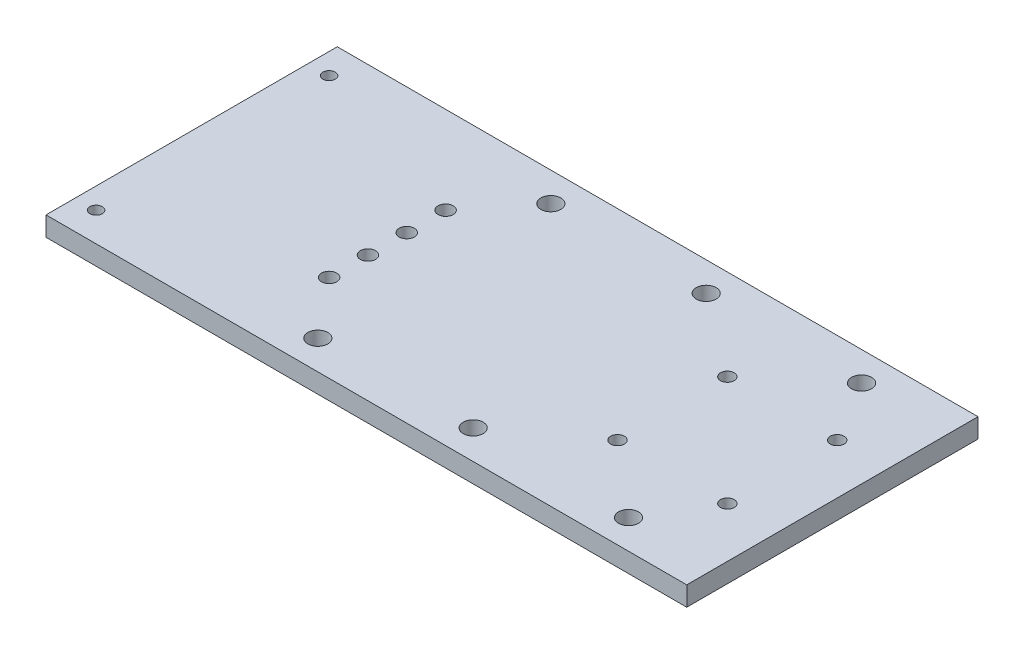
ISO-10303-21;
HEADER;
FILE_DESCRIPTION(('STEP AP214'),'2;1');
FILE_NAME('part.step','',(''),(''),'','','');
FILE_SCHEMA(('AUTOMOTIVE_DESIGN { 1 0 10303 214 1 1 1 1 }'));
ENDSEC;
DATA;
#1=APPLICATION_CONTEXT('core data for automotive mechanical design processes');
#2=APPLICATION_PROTOCOL_DEFINITION('international standard','automotive_design',2000,#1);
#3=PRODUCT_CONTEXT('',#1,'mechanical');
#4=PRODUCT('Part','Part','',(#3));
#5=PRODUCT_RELATED_PRODUCT_CATEGORY('part','',(#4));
#6=PRODUCT_DEFINITION_FORMATION('','',#4);
#7=PRODUCT_DEFINITION_CONTEXT('part definition',#1,'design');
#8=PRODUCT_DEFINITION('design','',#6,#7);
#9=PRODUCT_DEFINITION_SHAPE('','',#8);
#10=(LENGTH_UNIT() NAMED_UNIT(*) SI_UNIT(.MILLI.,.METRE.));
#11=(NAMED_UNIT(*) PLANE_ANGLE_UNIT() SI_UNIT($,.RADIAN.));
#12=(NAMED_UNIT(*) SI_UNIT($,.STERADIAN.) SOLID_ANGLE_UNIT());
#13=UNCERTAINTY_MEASURE_WITH_UNIT(LENGTH_MEASURE(1.E-05),#10,'distance_accuracy_value','');
#14=(GEOMETRIC_REPRESENTATION_CONTEXT(3) GLOBAL_UNCERTAINTY_ASSIGNED_CONTEXT((#13)) GLOBAL_UNIT_ASSIGNED_CONTEXT((#10,
#11,#12)) REPRESENTATION_CONTEXT('',''));
#15=CARTESIAN_POINT('',(0.,0.,0.));
#16=DIRECTION('',(0.,0.,1.));
#17=DIRECTION('',(1.,0.,0.));
#18=AXIS2_PLACEMENT_3D('',#15,#16,#17);
#19=CARTESIAN_POINT('',(104.775,6.35,47.625));
#20=DIRECTION('',(-1.,0.,0.));
#21=DIRECTION('',(0.,0.,1.));
#22=AXIS2_PLACEMENT_3D('',#19,#20,#21);
#23=PLANE('',#22);
#24=DIRECTION('',(0.,0.,-1.));
#25=VECTOR('',#24,1.);
#26=CARTESIAN_POINT('',(104.775,0.,47.625));
#27=LINE('',#26,#25);
#28=CARTESIAN_POINT('',(104.775,0.,47.625));
#29=VERTEX_POINT('',#28);
#30=CARTESIAN_POINT('',(104.775,0.,-47.625));
#31=VERTEX_POINT('',#30);
#32=EDGE_CURVE('E99',#29,#31,#27,.T.);
#33=ORIENTED_EDGE('',*,*,#32,.T.);
#34=DIRECTION('',(0.,-1.,0.));
#35=VECTOR('',#34,1.);
#36=CARTESIAN_POINT('',(104.775,6.35,-47.625));
#37=LINE('',#36,#35);
#38=CARTESIAN_POINT('',(104.775,6.35,-47.625));
#39=VERTEX_POINT('',#38);
#40=EDGE_CURVE('E11',#39,#31,#37,.T.);
#41=ORIENTED_EDGE('',*,*,#40,.F.);
#42=DIRECTION('',(0.,0.,-1.));
#43=VECTOR('',#42,1.);
#44=CARTESIAN_POINT('',(104.775,6.35,47.625));
#45=LINE('',#44,#43);
#46=CARTESIAN_POINT('',(104.775,6.35,47.625));
#47=VERTEX_POINT('',#46);
#48=EDGE_CURVE('E87',#47,#39,#45,.T.);
#49=ORIENTED_EDGE('',*,*,#48,.F.);
#50=DIRECTION('',(0.,-1.,0.));
#51=VECTOR('',#50,1.);
#52=CARTESIAN_POINT('',(104.775,6.35,47.625));
#53=LINE('',#52,#51);
#54=EDGE_CURVE('E95',#47,#29,#53,.T.);
#55=ORIENTED_EDGE('',*,*,#54,.T.);
#56=EDGE_LOOP('',(#33,#41,#49,#55));
#57=FACE_BOUND('',#56,.T.);
#58=ADVANCED_FACE('F36',(#57),#23,.F.);
#59=CARTESIAN_POINT('',(-104.775,6.35,-47.625));
#60=DIRECTION('',(0.,0.,1.));
#61=DIRECTION('',(1.,0.,0.));
#62=AXIS2_PLACEMENT_3D('',#59,#60,#61);
#63=PLANE('',#62);
#64=DIRECTION('',(-1.,0.,0.));
#65=VECTOR('',#64,1.);
#66=CARTESIAN_POINT('',(-104.775,0.,-47.625));
#67=LINE('',#66,#65);
#68=CARTESIAN_POINT('',(-104.775,0.,-47.625));
#69=VERTEX_POINT('',#68);
#70=EDGE_CURVE('E91',#31,#69,#67,.T.);
#71=ORIENTED_EDGE('',*,*,#70,.T.);
#72=DIRECTION('',(0.,-1.,0.));
#73=VECTOR('',#72,1.);
#74=CARTESIAN_POINT('',(-104.775,6.35,-47.625));
#75=LINE('',#74,#73);
#76=CARTESIAN_POINT('',(-104.775,6.35,-47.625));
#77=VERTEX_POINT('',#76);
#78=EDGE_CURVE('E44',#77,#69,#75,.T.);
#79=ORIENTED_EDGE('',*,*,#78,.F.);
#80=DIRECTION('',(-1.,0.,0.));
#81=VECTOR('',#80,1.);
#82=CARTESIAN_POINT('',(-104.775,6.35,-47.625));
#83=LINE('',#82,#81);
#84=EDGE_CURVE('E82',#39,#77,#83,.T.);
#85=ORIENTED_EDGE('',*,*,#84,.F.);
#86=ORIENTED_EDGE('',*,*,#40,.T.);
#87=EDGE_LOOP('',(#71,#79,#85,#86));
#88=FACE_BOUND('',#87,.T.);
#89=ADVANCED_FACE('F90',(#88),#63,.F.);
#90=CARTESIAN_POINT('',(-104.775,6.35,47.625));
#91=DIRECTION('',(1.,0.,0.));
#92=DIRECTION('',(0.,0.,-1.));
#93=AXIS2_PLACEMENT_3D('',#90,#91,#92);
#94=PLANE('',#93);
#95=DIRECTION('',(0.,0.,1.));
#96=VECTOR('',#95,1.);
#97=CARTESIAN_POINT('',(-104.775,0.,47.625));
#98=LINE('',#97,#96);
#99=CARTESIAN_POINT('',(-104.775,0.,47.625));
#100=VERTEX_POINT('',#99);
#101=EDGE_CURVE('E69',#69,#100,#98,.T.);
#102=ORIENTED_EDGE('',*,*,#101,.T.);
#103=DIRECTION('',(0.,-1.,0.));
#104=VECTOR('',#103,1.);
#105=CARTESIAN_POINT('',(-104.775,6.35,47.625));
#106=LINE('',#105,#104);
#107=CARTESIAN_POINT('',(-104.775,6.35,47.625));
#108=VERTEX_POINT('',#107);
#109=EDGE_CURVE('E92',#108,#100,#106,.T.);
#110=ORIENTED_EDGE('',*,*,#109,.F.);
#111=DIRECTION('',(0.,0.,1.));
#112=VECTOR('',#111,1.);
#113=CARTESIAN_POINT('',(-104.775,6.35,47.625));
#114=LINE('',#113,#112);
#115=EDGE_CURVE('E85',#77,#108,#114,.T.);
#116=ORIENTED_EDGE('',*,*,#115,.F.);
#117=ORIENTED_EDGE('',*,*,#78,.T.);
#118=EDGE_LOOP('',(#102,#110,#116,#117));
#119=FACE_BOUND('',#118,.T.);
#120=ADVANCED_FACE('F93',(#119),#94,.F.);
#121=CARTESIAN_POINT('',(-104.775,6.35,47.625));
#122=DIRECTION('',(0.,0.,-1.));
#123=DIRECTION('',(-1.,0.,0.));
#124=AXIS2_PLACEMENT_3D('',#121,#122,#123);
#125=PLANE('',#124);
#126=DIRECTION('',(1.,0.,0.));
#127=VECTOR('',#126,1.);
#128=CARTESIAN_POINT('',(-104.775,0.,47.625));
#129=LINE('',#128,#127);
#130=EDGE_CURVE('E75',#100,#29,#129,.T.);
#131=ORIENTED_EDGE('',*,*,#130,.T.);
#132=ORIENTED_EDGE('',*,*,#54,.F.);
#133=DIRECTION('',(1.,0.,0.));
#134=VECTOR('',#133,1.);
#135=CARTESIAN_POINT('',(-104.775,6.35,47.625));
#136=LINE('',#135,#134);
#137=EDGE_CURVE('E52',#108,#47,#136,.T.);
#138=ORIENTED_EDGE('',*,*,#137,.F.);
#139=ORIENTED_EDGE('',*,*,#109,.T.);
#140=EDGE_LOOP('',(#131,#132,#138,#139));
#141=FACE_BOUND('',#140,.T.);
#142=ADVANCED_FACE('F107',(#141),#125,.F.);
#143=CARTESIAN_POINT('',(0.,6.35,0.));
#144=DIRECTION('',(0.,-1.,0.));
#145=DIRECTION('',(0.,0.,-1.));
#146=AXIS2_PLACEMENT_3D('',#143,#144,#145);
#147=PLANE('',#146);
#148=CARTESIAN_POINT('',(-25.4,6.35,38.1));
#149=DIRECTION('',(0.,-1.,0.));
#150=DIRECTION('',(0.,0.,-1.));
#151=AXIS2_PLACEMENT_3D('',#148,#149,#150);
#152=CIRCLE('',#151,3.2639);
#153=CARTESIAN_POINT('',(-25.4,6.35,34.8361));
#154=VERTEX_POINT('',#153);
#155=EDGE_CURVE('E203',#154,#154,#152,.T.);
#156=ORIENTED_EDGE('',*,*,#155,.T.);
#157=EDGE_LOOP('',(#156));
#158=FACE_BOUND('',#157,.T.);
#159=CARTESIAN_POINT('',(25.4,6.35,38.1));
#160=DIRECTION('',(0.,-1.,0.));
#161=DIRECTION('',(0.,0.,-1.));
#162=AXIS2_PLACEMENT_3D('',#159,#160,#161);
#163=CIRCLE('',#162,3.2639);
#164=CARTESIAN_POINT('',(25.4,6.35,34.8361));
#165=VERTEX_POINT('',#164);
#166=EDGE_CURVE('E197',#165,#165,#163,.T.);
#167=ORIENTED_EDGE('',*,*,#166,.T.);
#168=EDGE_LOOP('',(#167));
#169=FACE_BOUND('',#168,.T.);
#170=CARTESIAN_POINT('',(76.2,6.35,38.1));
#171=DIRECTION('',(0.,-1.,0.));
#172=DIRECTION('',(0.,0.,-1.));
#173=AXIS2_PLACEMENT_3D('',#170,#171,#172);
#174=CIRCLE('',#173,3.2639);
#175=CARTESIAN_POINT('',(76.2,6.35,34.8361));
#176=VERTEX_POINT('',#175);
#177=EDGE_CURVE('E191',#176,#176,#174,.T.);
#178=ORIENTED_EDGE('',*,*,#177,.T.);
#179=EDGE_LOOP('',(#178));
#180=FACE_BOUND('',#179,.T.);
#181=CARTESIAN_POINT('',(-25.4,6.35,-38.1));
#182=DIRECTION('',(0.,1.,0.));
#183=DIRECTION('',(0.,0.,1.));
#184=AXIS2_PLACEMENT_3D('',#181,#182,#183);
#185=CIRCLE('',#184,3.2639);
#186=CARTESIAN_POINT('',(-25.4,6.35,-34.8361));
#187=VERTEX_POINT('',#186);
#188=EDGE_CURVE('E186',#187,#187,#185,.T.);
#189=ORIENTED_EDGE('',*,*,#188,.F.);
#190=EDGE_LOOP('',(#189));
#191=FACE_BOUND('',#190,.T.);
#192=CARTESIAN_POINT('',(25.4,6.35,-38.1));
#193=DIRECTION('',(0.,1.,0.));
#194=DIRECTION('',(0.,0.,1.));
#195=AXIS2_PLACEMENT_3D('',#192,#193,#194);
#196=CIRCLE('',#195,3.2639);
#197=CARTESIAN_POINT('',(25.4,6.35,-34.8361));
#198=VERTEX_POINT('',#197);
#199=EDGE_CURVE('E180',#198,#198,#196,.T.);
#200=ORIENTED_EDGE('',*,*,#199,.F.);
#201=EDGE_LOOP('',(#200));
#202=FACE_BOUND('',#201,.T.);
#203=CARTESIAN_POINT('',(76.2,6.35,-38.1));
#204=DIRECTION('',(0.,1.,0.));
#205=DIRECTION('',(0.,0.,1.));
#206=AXIS2_PLACEMENT_3D('',#203,#204,#205);
#207=CIRCLE('',#206,3.2639);
#208=CARTESIAN_POINT('',(76.2,6.35,-34.8361));
#209=VERTEX_POINT('',#208);
#210=EDGE_CURVE('E173',#209,#209,#207,.T.);
#211=ORIENTED_EDGE('',*,*,#210,.F.);
#212=EDGE_LOOP('',(#211));
#213=FACE_BOUND('',#212,.T.);
#214=CARTESIAN_POINT('',(52.47132,6.35,17.96034));
#215=DIRECTION('',(0.,1.,0.));
#216=DIRECTION('',(0.,0.,1.));
#217=AXIS2_PLACEMENT_3D('',#214,#215,#216);
#218=CIRCLE('',#217,2.2479);
#219=CARTESIAN_POINT('',(52.47132,6.35,20.20824));
#220=VERTEX_POINT('',#219);
#221=EDGE_CURVE('E155',#220,#220,#218,.T.);
#222=ORIENTED_EDGE('',*,*,#221,.F.);
#223=EDGE_LOOP('',(#222));
#224=FACE_BOUND('',#223,.T.);
#225=CARTESIAN_POINT('',(88.392,6.35,17.96034));
#226=DIRECTION('',(0.,1.,0.));
#227=DIRECTION('',(0.,0.,1.));
#228=AXIS2_PLACEMENT_3D('',#225,#226,#227);
#229=CIRCLE('',#228,2.2479);
#230=CARTESIAN_POINT('',(88.392,6.35,20.20824));
#231=VERTEX_POINT('',#230);
#232=EDGE_CURVE('E162',#231,#231,#229,.T.);
#233=ORIENTED_EDGE('',*,*,#232,.F.);
#234=EDGE_LOOP('',(#233));
#235=FACE_BOUND('',#234,.T.);
#236=CARTESIAN_POINT('',(88.392,6.35,-17.96034));
#237=DIRECTION('',(0.,1.,0.));
#238=DIRECTION('',(0.,0.,1.));
#239=AXIS2_PLACEMENT_3D('',#236,#237,#238);
#240=CIRCLE('',#239,2.2479);
#241=CARTESIAN_POINT('',(88.392,6.35,-15.71244));
#242=VERTEX_POINT('',#241);
#243=EDGE_CURVE('E168',#242,#242,#240,.T.);
#244=ORIENTED_EDGE('',*,*,#243,.F.);
#245=EDGE_LOOP('',(#244));
#246=FACE_BOUND('',#245,.T.);
#247=CARTESIAN_POINT('',(52.47132,6.35,-17.96034));
#248=DIRECTION('',(0.,1.,0.));
#249=DIRECTION('',(0.,0.,1.));
#250=AXIS2_PLACEMENT_3D('',#247,#248,#249);
#251=CIRCLE('',#250,2.2479);
#252=CARTESIAN_POINT('',(52.47132,6.35,-15.71244));
#253=VERTEX_POINT('',#252);
#254=EDGE_CURVE('E149',#253,#253,#251,.T.);
#255=ORIENTED_EDGE('',*,*,#254,.F.);
#256=EDGE_LOOP('',(#255));
#257=FACE_BOUND('',#256,.T.);
#258=CARTESIAN_POINT('',(-40.767,6.35,-6.35));
#259=DIRECTION('',(0.,-1.,0.));
#260=DIRECTION('',(0.,0.,-1.));
#261=AXIS2_PLACEMENT_3D('',#258,#259,#260);
#262=CIRCLE('',#261,2.4892);
#263=CARTESIAN_POINT('',(-40.767,6.35,-8.83920000000001));
#264=VERTEX_POINT('',#263);
#265=EDGE_CURVE('E144',#264,#264,#262,.T.);
#266=ORIENTED_EDGE('',*,*,#265,.T.);
#267=EDGE_LOOP('',(#266));
#268=FACE_BOUND('',#267,.T.);
#269=CARTESIAN_POINT('',(-40.767,6.35,-19.05));
#270=DIRECTION('',(0.,-1.,0.));
#271=DIRECTION('',(0.,0.,-1.));
#272=AXIS2_PLACEMENT_3D('',#269,#270,#271);
#273=CIRCLE('',#272,2.4892);
#274=CARTESIAN_POINT('',(-40.767,6.35,-21.5392));
#275=VERTEX_POINT('',#274);
#276=EDGE_CURVE('E137',#275,#275,#273,.T.);
#277=ORIENTED_EDGE('',*,*,#276,.T.);
#278=EDGE_LOOP('',(#277));
#279=FACE_BOUND('',#278,.T.);
#280=CARTESIAN_POINT('',(-40.767,6.35,6.35));
#281=DIRECTION('',(0.,1.,0.));
#282=DIRECTION('',(0.,0.,1.));
#283=AXIS2_PLACEMENT_3D('',#280,#281,#282);
#284=CIRCLE('',#283,2.4892);
#285=CARTESIAN_POINT('',(-40.767,6.35,8.83920000000001));
#286=VERTEX_POINT('',#285);
#287=EDGE_CURVE('E132',#286,#286,#284,.T.);
#288=ORIENTED_EDGE('',*,*,#287,.F.);
#289=EDGE_LOOP('',(#288));
#290=FACE_BOUND('',#289,.T.);
#291=CARTESIAN_POINT('',(-40.767,6.35,19.05));
#292=DIRECTION('',(0.,1.,0.));
#293=DIRECTION('',(0.,0.,1.));
#294=AXIS2_PLACEMENT_3D('',#291,#292,#293);
#295=CIRCLE('',#294,2.4892);
#296=CARTESIAN_POINT('',(-40.767,6.35,21.5392));
#297=VERTEX_POINT('',#296);
#298=EDGE_CURVE('E125',#297,#297,#295,.T.);
#299=ORIENTED_EDGE('',*,*,#298,.F.);
#300=EDGE_LOOP('',(#299));
#301=FACE_BOUND('',#300,.T.);
#302=CARTESIAN_POINT('',(-97.917,6.35,-38.1));
#303=DIRECTION('',(0.,-1.,0.));
#304=DIRECTION('',(0.,0.,-1.));
#305=AXIS2_PLACEMENT_3D('',#302,#303,#304);
#306=CIRCLE('',#305,2.01930000000001);
#307=CARTESIAN_POINT('',(-97.917,6.35,-40.1193));
#308=VERTEX_POINT('',#307);
#309=EDGE_CURVE('E119',#308,#308,#306,.T.);
#310=ORIENTED_EDGE('',*,*,#309,.T.);
#311=EDGE_LOOP('',(#310));
#312=FACE_BOUND('',#311,.T.);
#313=CARTESIAN_POINT('',(-97.917,6.35,38.1));
#314=DIRECTION('',(0.,1.,0.));
#315=DIRECTION('',(0.,0.,1.));
#316=AXIS2_PLACEMENT_3D('',#313,#314,#315);
#317=CIRCLE('',#316,2.01930000000001);
#318=CARTESIAN_POINT('',(-97.917,6.35,40.1193));
#319=VERTEX_POINT('',#318);
#320=EDGE_CURVE('E113',#319,#319,#317,.T.);
#321=ORIENTED_EDGE('',*,*,#320,.F.);
#322=EDGE_LOOP('',(#321));
#323=FACE_BOUND('',#322,.T.);
#324=ORIENTED_EDGE('',*,*,#48,.T.);
#325=ORIENTED_EDGE('',*,*,#84,.T.);
#326=ORIENTED_EDGE('',*,*,#115,.T.);
#327=ORIENTED_EDGE('',*,*,#137,.T.);
#328=EDGE_LOOP('',(#324,#325,#326,#327));
#329=FACE_BOUND('',#328,.T.);
#330=ADVANCED_FACE('F83',(#158,#169,#180,#191,#202,#213,#224,#235,#246,#257,#268,#279,#290,#301,
#312,#323,#329),#147,.F.);
#331=CARTESIAN_POINT('',(0.,0.,0.));
#332=DIRECTION('',(0.,-1.,0.));
#333=DIRECTION('',(0.,0.,-1.));
#334=AXIS2_PLACEMENT_3D('',#331,#332,#333);
#335=PLANE('',#334);
#336=CARTESIAN_POINT('',(-25.4,0.,38.1));
#337=DIRECTION('',(0.,-1.,0.));
#338=DIRECTION('',(0.,0.,-1.));
#339=AXIS2_PLACEMENT_3D('',#336,#337,#338);
#340=CIRCLE('',#339,3.2639);
#341=CARTESIAN_POINT('',(-25.4,0.,34.8361));
#342=VERTEX_POINT('',#341);
#343=EDGE_CURVE('E177',#342,#342,#340,.T.);
#344=ORIENTED_EDGE('',*,*,#343,.F.);
#345=EDGE_LOOP('',(#344));
#346=FACE_BOUND('',#345,.T.);
#347=CARTESIAN_POINT('',(25.4,0.,38.1));
#348=DIRECTION('',(0.,-1.,0.));
#349=DIRECTION('',(0.,0.,-1.));
#350=AXIS2_PLACEMENT_3D('',#347,#348,#349);
#351=CIRCLE('',#350,3.2639);
#352=CARTESIAN_POINT('',(25.4,0.,34.8361));
#353=VERTEX_POINT('',#352);
#354=EDGE_CURVE('E200',#353,#353,#351,.T.);
#355=ORIENTED_EDGE('',*,*,#354,.F.);
#356=EDGE_LOOP('',(#355));
#357=FACE_BOUND('',#356,.T.);
#358=CARTESIAN_POINT('',(76.2,0.,38.1));
#359=DIRECTION('',(0.,-1.,0.));
#360=DIRECTION('',(0.,0.,-1.));
#361=AXIS2_PLACEMENT_3D('',#358,#359,#360);
#362=CIRCLE('',#361,3.2639);
#363=CARTESIAN_POINT('',(76.2,0.,34.8361));
#364=VERTEX_POINT('',#363);
#365=EDGE_CURVE('E194',#364,#364,#362,.T.);
#366=ORIENTED_EDGE('',*,*,#365,.F.);
#367=EDGE_LOOP('',(#366));
#368=FACE_BOUND('',#367,.T.);
#369=CARTESIAN_POINT('',(-25.4,0.,-38.1));
#370=DIRECTION('',(0.,1.,0.));
#371=DIRECTION('',(0.,0.,1.));
#372=AXIS2_PLACEMENT_3D('',#369,#370,#371);
#373=CIRCLE('',#372,3.2639);
#374=CARTESIAN_POINT('',(-25.4,0.,-34.8361));
#375=VERTEX_POINT('',#374);
#376=EDGE_CURVE('E159',#375,#375,#373,.T.);
#377=ORIENTED_EDGE('',*,*,#376,.T.);
#378=EDGE_LOOP('',(#377));
#379=FACE_BOUND('',#378,.T.);
#380=CARTESIAN_POINT('',(25.4,0.,-38.1));
#381=DIRECTION('',(0.,1.,0.));
#382=DIRECTION('',(0.,0.,1.));
#383=AXIS2_PLACEMENT_3D('',#380,#381,#382);
#384=CIRCLE('',#383,3.2639);
#385=CARTESIAN_POINT('',(25.4,0.,-34.8361));
#386=VERTEX_POINT('',#385);
#387=EDGE_CURVE('E183',#386,#386,#384,.T.);
#388=ORIENTED_EDGE('',*,*,#387,.T.);
#389=EDGE_LOOP('',(#388));
#390=FACE_BOUND('',#389,.T.);
#391=CARTESIAN_POINT('',(76.2,0.,-38.1));
#392=DIRECTION('',(0.,1.,0.));
#393=DIRECTION('',(0.,0.,1.));
#394=AXIS2_PLACEMENT_3D('',#391,#392,#393);
#395=CIRCLE('',#394,3.2639);
#396=CARTESIAN_POINT('',(76.2,0.,-34.8361));
#397=VERTEX_POINT('',#396);
#398=EDGE_CURVE('E176',#397,#397,#395,.T.);
#399=ORIENTED_EDGE('',*,*,#398,.T.);
#400=EDGE_LOOP('',(#399));
#401=FACE_BOUND('',#400,.T.);
#402=CARTESIAN_POINT('',(52.47132,0.,17.96034));
#403=DIRECTION('',(0.,1.,0.));
#404=DIRECTION('',(0.,0.,1.));
#405=AXIS2_PLACEMENT_3D('',#402,#403,#404);
#406=CIRCLE('',#405,2.2479);
#407=CARTESIAN_POINT('',(52.47132,0.,20.20824));
#408=VERTEX_POINT('',#407);
#409=EDGE_CURVE('E158',#408,#408,#406,.T.);
#410=ORIENTED_EDGE('',*,*,#409,.T.);
#411=EDGE_LOOP('',(#410));
#412=FACE_BOUND('',#411,.T.);
#413=CARTESIAN_POINT('',(88.392,0.,17.96034));
#414=DIRECTION('',(0.,1.,0.));
#415=DIRECTION('',(0.,0.,1.));
#416=AXIS2_PLACEMENT_3D('',#413,#414,#415);
#417=CIRCLE('',#416,2.2479);
#418=CARTESIAN_POINT('',(88.392,0.,20.20824));
#419=VERTEX_POINT('',#418);
#420=EDGE_CURVE('E165',#419,#419,#417,.T.);
#421=ORIENTED_EDGE('',*,*,#420,.T.);
#422=EDGE_LOOP('',(#421));
#423=FACE_BOUND('',#422,.T.);
#424=CARTESIAN_POINT('',(88.392,0.,-17.96034));
#425=DIRECTION('',(0.,1.,0.));
#426=DIRECTION('',(0.,0.,1.));
#427=AXIS2_PLACEMENT_3D('',#424,#425,#426);
#428=CIRCLE('',#427,2.2479);
#429=CARTESIAN_POINT('',(88.392,0.,-15.71244));
#430=VERTEX_POINT('',#429);
#431=EDGE_CURVE('E152',#430,#430,#428,.T.);
#432=ORIENTED_EDGE('',*,*,#431,.T.);
#433=EDGE_LOOP('',(#432));
#434=FACE_BOUND('',#433,.T.);
#435=CARTESIAN_POINT('',(52.47132,0.,-17.96034));
#436=DIRECTION('',(0.,1.,0.));
#437=DIRECTION('',(0.,0.,1.));
#438=AXIS2_PLACEMENT_3D('',#435,#436,#437);
#439=CIRCLE('',#438,2.2479);
#440=CARTESIAN_POINT('',(52.47132,0.,-15.71244));
#441=VERTEX_POINT('',#440);
#442=EDGE_CURVE('E141',#441,#441,#439,.T.);
#443=ORIENTED_EDGE('',*,*,#442,.T.);
#444=EDGE_LOOP('',(#443));
#445=FACE_BOUND('',#444,.T.);
#446=CARTESIAN_POINT('',(-40.767,0.,-6.35));
#447=DIRECTION('',(0.,-1.,0.));
#448=DIRECTION('',(0.,0.,-1.));
#449=AXIS2_PLACEMENT_3D('',#446,#447,#448);
#450=CIRCLE('',#449,2.4892);
#451=CARTESIAN_POINT('',(-40.767,0.,-8.83920000000001));
#452=VERTEX_POINT('',#451);
#453=EDGE_CURVE('E129',#452,#452,#450,.T.);
#454=ORIENTED_EDGE('',*,*,#453,.F.);
#455=EDGE_LOOP('',(#454));
#456=FACE_BOUND('',#455,.T.);
#457=CARTESIAN_POINT('',(-40.767,0.,-19.05));
#458=DIRECTION('',(0.,-1.,0.));
#459=DIRECTION('',(0.,0.,-1.));
#460=AXIS2_PLACEMENT_3D('',#457,#458,#459);
#461=CIRCLE('',#460,2.4892);
#462=CARTESIAN_POINT('',(-40.767,0.,-21.5392));
#463=VERTEX_POINT('',#462);
#464=EDGE_CURVE('E140',#463,#463,#461,.T.);
#465=ORIENTED_EDGE('',*,*,#464,.F.);
#466=EDGE_LOOP('',(#465));
#467=FACE_BOUND('',#466,.T.);
#468=CARTESIAN_POINT('',(-40.767,0.,6.35));
#469=DIRECTION('',(0.,1.,0.));
#470=DIRECTION('',(0.,0.,1.));
#471=AXIS2_PLACEMENT_3D('',#468,#469,#470);
#472=CIRCLE('',#471,2.4892);
#473=CARTESIAN_POINT('',(-40.767,0.,8.83920000000001));
#474=VERTEX_POINT('',#473);
#475=EDGE_CURVE('E122',#474,#474,#472,.T.);
#476=ORIENTED_EDGE('',*,*,#475,.T.);
#477=EDGE_LOOP('',(#476));
#478=FACE_BOUND('',#477,.T.);
#479=CARTESIAN_POINT('',(-40.767,0.,19.05));
#480=DIRECTION('',(0.,1.,0.));
#481=DIRECTION('',(0.,0.,1.));
#482=AXIS2_PLACEMENT_3D('',#479,#480,#481);
#483=CIRCLE('',#482,2.4892);
#484=CARTESIAN_POINT('',(-40.767,0.,21.5392));
#485=VERTEX_POINT('',#484);
#486=EDGE_CURVE('E128',#485,#485,#483,.T.);
#487=ORIENTED_EDGE('',*,*,#486,.T.);
#488=EDGE_LOOP('',(#487));
#489=FACE_BOUND('',#488,.T.);
#490=CARTESIAN_POINT('',(-97.917,0.,-38.1));
#491=DIRECTION('',(0.,-1.,0.));
#492=DIRECTION('',(0.,0.,-1.));
#493=AXIS2_PLACEMENT_3D('',#490,#491,#492);
#494=CIRCLE('',#493,2.01930000000001);
#495=CARTESIAN_POINT('',(-97.917,0.,-40.1193));
#496=VERTEX_POINT('',#495);
#497=EDGE_CURVE('E116',#496,#496,#494,.T.);
#498=ORIENTED_EDGE('',*,*,#497,.F.);
#499=EDGE_LOOP('',(#498));
#500=FACE_BOUND('',#499,.T.);
#501=CARTESIAN_POINT('',(-97.917,0.,38.1));
#502=DIRECTION('',(0.,1.,0.));
#503=DIRECTION('',(0.,0.,1.));
#504=AXIS2_PLACEMENT_3D('',#501,#502,#503);
#505=CIRCLE('',#504,2.01930000000001);
#506=CARTESIAN_POINT('',(-97.917,0.,40.1193));
#507=VERTEX_POINT('',#506);
#508=EDGE_CURVE('E102',#507,#507,#505,.T.);
#509=ORIENTED_EDGE('',*,*,#508,.T.);
#510=EDGE_LOOP('',(#509));
#511=FACE_BOUND('',#510,.T.);
#512=ORIENTED_EDGE('',*,*,#32,.F.);
#513=ORIENTED_EDGE('',*,*,#130,.F.);
#514=ORIENTED_EDGE('',*,*,#101,.F.);
#515=ORIENTED_EDGE('',*,*,#70,.F.);
#516=EDGE_LOOP('',(#512,#513,#514,#515));
#517=FACE_BOUND('',#516,.T.);
#518=ADVANCED_FACE('F110',(#346,#357,#368,#379,#390,#401,#412,#423,#434,#445,#456,#467,#478,
#489,#500,#511,#517),#335,.T.);
#519=CARTESIAN_POINT('',(-97.917,0.,38.1));
#520=DIRECTION('',(0.,1.,0.));
#521=DIRECTION('',(0.,0.,1.));
#522=AXIS2_PLACEMENT_3D('',#519,#520,#521);
#523=CYLINDRICAL_SURFACE('',#522,2.01930000000001);
#524=ORIENTED_EDGE('',*,*,#508,.F.);
#525=EDGE_LOOP('',(#524));
#526=FACE_BOUND('',#525,.T.);
#527=ORIENTED_EDGE('',*,*,#320,.T.);
#528=EDGE_LOOP('',(#527));
#529=FACE_BOUND('',#528,.T.);
#530=ADVANCED_FACE('F214',(#526,#529),#523,.F.);
#531=CARTESIAN_POINT('',(-97.917,0.,-38.1));
#532=DIRECTION('',(0.,1.,0.));
#533=DIRECTION('',(0.,0.,1.));
#534=AXIS2_PLACEMENT_3D('',#531,#532,#533);
#535=CYLINDRICAL_SURFACE('',#534,2.01930000000001);
#536=ORIENTED_EDGE('',*,*,#497,.T.);
#537=EDGE_LOOP('',(#536));
#538=FACE_BOUND('',#537,.T.);
#539=ORIENTED_EDGE('',*,*,#309,.F.);
#540=EDGE_LOOP('',(#539));
#541=FACE_BOUND('',#540,.T.);
#542=ADVANCED_FACE('F248',(#538,#541),#535,.F.);
#543=CARTESIAN_POINT('',(-40.767,0.,19.05));
#544=DIRECTION('',(0.,1.,0.));
#545=DIRECTION('',(0.,0.,1.));
#546=AXIS2_PLACEMENT_3D('',#543,#544,#545);
#547=CYLINDRICAL_SURFACE('',#546,2.4892);
#548=ORIENTED_EDGE('',*,*,#486,.F.);
#549=EDGE_LOOP('',(#548));
#550=FACE_BOUND('',#549,.T.);
#551=ORIENTED_EDGE('',*,*,#298,.T.);
#552=EDGE_LOOP('',(#551));
#553=FACE_BOUND('',#552,.T.);
#554=ADVANCED_FACE('F291',(#550,#553),#547,.F.);
#555=CARTESIAN_POINT('',(-40.767,0.,6.35));
#556=DIRECTION('',(0.,1.,0.));
#557=DIRECTION('',(0.,0.,1.));
#558=AXIS2_PLACEMENT_3D('',#555,#556,#557);
#559=CYLINDRICAL_SURFACE('',#558,2.4892);
#560=ORIENTED_EDGE('',*,*,#475,.F.);
#561=EDGE_LOOP('',(#560));
#562=FACE_BOUND('',#561,.T.);
#563=ORIENTED_EDGE('',*,*,#287,.T.);
#564=EDGE_LOOP('',(#563));
#565=FACE_BOUND('',#564,.T.);
#566=ADVANCED_FACE('F301',(#562,#565),#559,.F.);
#567=CARTESIAN_POINT('',(-40.767,0.,-19.05));
#568=DIRECTION('',(0.,1.,0.));
#569=DIRECTION('',(0.,0.,1.));
#570=AXIS2_PLACEMENT_3D('',#567,#568,#569);
#571=CYLINDRICAL_SURFACE('',#570,2.4892);
#572=ORIENTED_EDGE('',*,*,#464,.T.);
#573=EDGE_LOOP('',(#572));
#574=FACE_BOUND('',#573,.T.);
#575=ORIENTED_EDGE('',*,*,#276,.F.);
#576=EDGE_LOOP('',(#575));
#577=FACE_BOUND('',#576,.T.);
#578=ADVANCED_FACE('F311',(#574,#577),#571,.F.);
#579=CARTESIAN_POINT('',(-40.767,0.,-6.35));
#580=DIRECTION('',(0.,1.,0.));
#581=DIRECTION('',(0.,0.,1.));
#582=AXIS2_PLACEMENT_3D('',#579,#580,#581);
#583=CYLINDRICAL_SURFACE('',#582,2.4892);
#584=ORIENTED_EDGE('',*,*,#453,.T.);
#585=EDGE_LOOP('',(#584));
#586=FACE_BOUND('',#585,.T.);
#587=ORIENTED_EDGE('',*,*,#265,.F.);
#588=EDGE_LOOP('',(#587));
#589=FACE_BOUND('',#588,.T.);
#590=ADVANCED_FACE('F321',(#586,#589),#583,.F.);
#591=CARTESIAN_POINT('',(52.47132,0.,-17.96034));
#592=DIRECTION('',(0.,1.,0.));
#593=DIRECTION('',(0.,0.,1.));
#594=AXIS2_PLACEMENT_3D('',#591,#592,#593);
#595=CYLINDRICAL_SURFACE('',#594,2.2479);
#596=ORIENTED_EDGE('',*,*,#442,.F.);
#597=EDGE_LOOP('',(#596));
#598=FACE_BOUND('',#597,.T.);
#599=ORIENTED_EDGE('',*,*,#254,.T.);
#600=EDGE_LOOP('',(#599));
#601=FACE_BOUND('',#600,.T.);
#602=ADVANCED_FACE('F331',(#598,#601),#595,.F.);
#603=CARTESIAN_POINT('',(88.392,0.,-17.96034));
#604=DIRECTION('',(0.,1.,0.));
#605=DIRECTION('',(0.,0.,1.));
#606=AXIS2_PLACEMENT_3D('',#603,#604,#605);
#607=CYLINDRICAL_SURFACE('',#606,2.2479);
#608=ORIENTED_EDGE('',*,*,#431,.F.);
#609=EDGE_LOOP('',(#608));
#610=FACE_BOUND('',#609,.T.);
#611=ORIENTED_EDGE('',*,*,#243,.T.);
#612=EDGE_LOOP('',(#611));
#613=FACE_BOUND('',#612,.T.);
#614=ADVANCED_FACE('F341',(#610,#613),#607,.F.);
#615=CARTESIAN_POINT('',(88.392,0.,17.96034));
#616=DIRECTION('',(0.,1.,0.));
#617=DIRECTION('',(0.,0.,1.));
#618=AXIS2_PLACEMENT_3D('',#615,#616,#617);
#619=CYLINDRICAL_SURFACE('',#618,2.2479);
#620=ORIENTED_EDGE('',*,*,#420,.F.);
#621=EDGE_LOOP('',(#620));
#622=FACE_BOUND('',#621,.T.);
#623=ORIENTED_EDGE('',*,*,#232,.T.);
#624=EDGE_LOOP('',(#623));
#625=FACE_BOUND('',#624,.T.);
#626=ADVANCED_FACE('F351',(#622,#625),#619,.F.);
#627=CARTESIAN_POINT('',(52.47132,0.,17.96034));
#628=DIRECTION('',(0.,1.,0.));
#629=DIRECTION('',(0.,0.,1.));
#630=AXIS2_PLACEMENT_3D('',#627,#628,#629);
#631=CYLINDRICAL_SURFACE('',#630,2.2479);
#632=ORIENTED_EDGE('',*,*,#409,.F.);
#633=EDGE_LOOP('',(#632));
#634=FACE_BOUND('',#633,.T.);
#635=ORIENTED_EDGE('',*,*,#221,.T.);
#636=EDGE_LOOP('',(#635));
#637=FACE_BOUND('',#636,.T.);
#638=ADVANCED_FACE('F361',(#634,#637),#631,.F.);
#639=CARTESIAN_POINT('',(76.2,0.,-38.1));
#640=DIRECTION('',(0.,1.,0.));
#641=DIRECTION('',(0.,0.,1.));
#642=AXIS2_PLACEMENT_3D('',#639,#640,#641);
#643=CYLINDRICAL_SURFACE('',#642,3.2639);
#644=ORIENTED_EDGE('',*,*,#398,.F.);
#645=EDGE_LOOP('',(#644));
#646=FACE_BOUND('',#645,.T.);
#647=ORIENTED_EDGE('',*,*,#210,.T.);
#648=EDGE_LOOP('',(#647));
#649=FACE_BOUND('',#648,.T.);
#650=ADVANCED_FACE('F371',(#646,#649),#643,.F.);
#651=CARTESIAN_POINT('',(25.4,0.,-38.1));
#652=DIRECTION('',(0.,1.,0.));
#653=DIRECTION('',(0.,0.,1.));
#654=AXIS2_PLACEMENT_3D('',#651,#652,#653);
#655=CYLINDRICAL_SURFACE('',#654,3.2639);
#656=ORIENTED_EDGE('',*,*,#387,.F.);
#657=EDGE_LOOP('',(#656));
#658=FACE_BOUND('',#657,.T.);
#659=ORIENTED_EDGE('',*,*,#199,.T.);
#660=EDGE_LOOP('',(#659));
#661=FACE_BOUND('',#660,.T.);
#662=ADVANCED_FACE('F381',(#658,#661),#655,.F.);
#663=CARTESIAN_POINT('',(-25.4,0.,-38.1));
#664=DIRECTION('',(0.,1.,0.));
#665=DIRECTION('',(0.,0.,1.));
#666=AXIS2_PLACEMENT_3D('',#663,#664,#665);
#667=CYLINDRICAL_SURFACE('',#666,3.2639);
#668=ORIENTED_EDGE('',*,*,#376,.F.);
#669=EDGE_LOOP('',(#668));
#670=FACE_BOUND('',#669,.T.);
#671=ORIENTED_EDGE('',*,*,#188,.T.);
#672=EDGE_LOOP('',(#671));
#673=FACE_BOUND('',#672,.T.);
#674=ADVANCED_FACE('F391',(#670,#673),#667,.F.);
#675=CARTESIAN_POINT('',(76.2,0.,38.1));
#676=DIRECTION('',(0.,1.,0.));
#677=DIRECTION('',(0.,0.,1.));
#678=AXIS2_PLACEMENT_3D('',#675,#676,#677);
#679=CYLINDRICAL_SURFACE('',#678,3.2639);
#680=ORIENTED_EDGE('',*,*,#365,.T.);
#681=EDGE_LOOP('',(#680));
#682=FACE_BOUND('',#681,.T.);
#683=ORIENTED_EDGE('',*,*,#177,.F.);
#684=EDGE_LOOP('',(#683));
#685=FACE_BOUND('',#684,.T.);
#686=ADVANCED_FACE('F400',(#682,#685),#679,.F.);
#687=CARTESIAN_POINT('',(25.4,0.,38.1));
#688=DIRECTION('',(0.,1.,0.));
#689=DIRECTION('',(0.,0.,1.));
#690=AXIS2_PLACEMENT_3D('',#687,#688,#689);
#691=CYLINDRICAL_SURFACE('',#690,3.2639);
#692=ORIENTED_EDGE('',*,*,#354,.T.);
#693=EDGE_LOOP('',(#692));
#694=FACE_BOUND('',#693,.T.);
#695=ORIENTED_EDGE('',*,*,#166,.F.);
#696=EDGE_LOOP('',(#695));
#697=FACE_BOUND('',#696,.T.);
#698=ADVANCED_FACE('F419',(#694,#697),#691,.F.);
#699=CARTESIAN_POINT('',(-25.4,0.,38.1));
#700=DIRECTION('',(0.,1.,0.));
#701=DIRECTION('',(0.,0.,1.));
#702=AXIS2_PLACEMENT_3D('',#699,#700,#701);
#703=CYLINDRICAL_SURFACE('',#702,3.2639);
#704=ORIENTED_EDGE('',*,*,#343,.T.);
#705=EDGE_LOOP('',(#704));
#706=FACE_BOUND('',#705,.T.);
#707=ORIENTED_EDGE('',*,*,#155,.F.);
#708=EDGE_LOOP('',(#707));
#709=FACE_BOUND('',#708,.T.);
#710=ADVANCED_FACE('F209',(#706,#709),#703,.F.);
#711=CLOSED_SHELL('',(#58,#89,#120,#142,#330,#518,#530,#542,#554,#566,#578,#590,#602,#614,#626,
#638,#650,#662,#674,#686,#698,#710));
#712=MANIFOLD_SOLID_BREP('B2',#711);
#713=ADVANCED_BREP_SHAPE_REPRESENTATION('',(#18,#712),#14);
#714=SHAPE_DEFINITION_REPRESENTATION(#9,#713);
ENDSEC;
END-ISO-10303-21;
